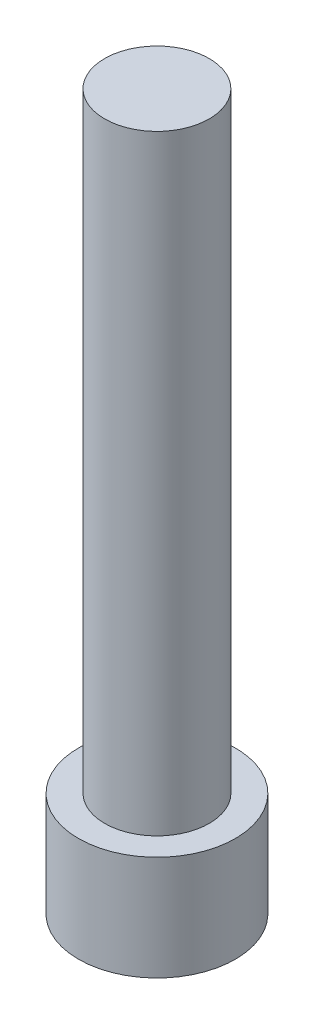
ISO-10303-21;
HEADER;
FILE_DESCRIPTION(('STEP AP214'),'2;1');
FILE_NAME('part.step','',(''),(''),'','','');
FILE_SCHEMA(('AUTOMOTIVE_DESIGN { 1 0 10303 214 1 1 1 1 }'));
ENDSEC;
DATA;
#1=APPLICATION_CONTEXT('core data for automotive mechanical design processes');
#2=APPLICATION_PROTOCOL_DEFINITION('international standard','automotive_design',2000,#1);
#3=PRODUCT_CONTEXT('',#1,'mechanical');
#4=PRODUCT('Part','Part','',(#3));
#5=PRODUCT_RELATED_PRODUCT_CATEGORY('part','',(#4));
#6=PRODUCT_DEFINITION_FORMATION('','',#4);
#7=PRODUCT_DEFINITION_CONTEXT('part definition',#1,'design');
#8=PRODUCT_DEFINITION('design','',#6,#7);
#9=PRODUCT_DEFINITION_SHAPE('','',#8);
#10=(LENGTH_UNIT() NAMED_UNIT(*) SI_UNIT(.MILLI.,.METRE.));
#11=(NAMED_UNIT(*) PLANE_ANGLE_UNIT() SI_UNIT($,.RADIAN.));
#12=(NAMED_UNIT(*) SI_UNIT($,.STERADIAN.) SOLID_ANGLE_UNIT());
#13=UNCERTAINTY_MEASURE_WITH_UNIT(LENGTH_MEASURE(1.E-05),#10,'distance_accuracy_value','');
#14=(GEOMETRIC_REPRESENTATION_CONTEXT(3) GLOBAL_UNCERTAINTY_ASSIGNED_CONTEXT((#13)) GLOBAL_UNIT_ASSIGNED_CONTEXT((#10,
#11,#12)) REPRESENTATION_CONTEXT('',''));
#15=CARTESIAN_POINT('',(0.,0.,0.));
#16=DIRECTION('',(0.,0.,1.));
#17=DIRECTION('',(1.,0.,0.));
#18=AXIS2_PLACEMENT_3D('',#15,#16,#17);
#19=CARTESIAN_POINT('',(0.,12.,0.));
#20=DIRECTION('',(0.,1.,0.));
#21=DIRECTION('',(0.,0.,1.));
#22=AXIS2_PLACEMENT_3D('',#19,#20,#21);
#23=PLANE('',#22);
#24=CARTESIAN_POINT('',(0.,12.,0.));
#25=DIRECTION('',(0.,1.,0.));
#26=DIRECTION('',(0.,0.,1.));
#27=AXIS2_PLACEMENT_3D('',#24,#25,#26);
#28=CIRCLE('',#27,9.);
#29=CARTESIAN_POINT('',(0.,12.,9.));
#30=VERTEX_POINT('',#29);
#31=EDGE_CURVE('E10',#30,#30,#28,.T.);
#32=ORIENTED_EDGE('',*,*,#31,.T.);
#33=EDGE_LOOP('',(#32));
#34=FACE_BOUND('',#33,.T.);
#35=CARTESIAN_POINT('',(0.,12.,0.));
#36=DIRECTION('',(0.,1.,0.));
#37=DIRECTION('',(0.,0.,1.));
#38=AXIS2_PLACEMENT_3D('',#35,#36,#37);
#39=CIRCLE('',#38,6.);
#40=CARTESIAN_POINT('',(0.,12.,6.));
#41=VERTEX_POINT('',#40);
#42=EDGE_CURVE('E42',#41,#41,#39,.T.);
#43=ORIENTED_EDGE('',*,*,#42,.F.);
#44=EDGE_LOOP('',(#43));
#45=FACE_BOUND('',#44,.T.);
#46=ADVANCED_FACE('F29',(#34,#45),#23,.T.);
#47=CARTESIAN_POINT('',(0.,12.,0.));
#48=DIRECTION('',(0.,-1.,0.));
#49=DIRECTION('',(0.,0.,-1.));
#50=AXIS2_PLACEMENT_3D('',#47,#48,#49);
#51=CYLINDRICAL_SURFACE('',#50,9.);
#52=ORIENTED_EDGE('',*,*,#31,.F.);
#53=EDGE_LOOP('',(#52));
#54=FACE_BOUND('',#53,.T.);
#55=CARTESIAN_POINT('',(0.,0.,0.));
#56=DIRECTION('',(0.,1.,0.));
#57=DIRECTION('',(0.,0.,1.));
#58=AXIS2_PLACEMENT_3D('',#55,#56,#57);
#59=CIRCLE('',#58,9.);
#60=CARTESIAN_POINT('',(0.,0.,9.));
#61=VERTEX_POINT('',#60);
#62=EDGE_CURVE('E33',#61,#61,#59,.T.);
#63=ORIENTED_EDGE('',*,*,#62,.T.);
#64=EDGE_LOOP('',(#63));
#65=FACE_BOUND('',#64,.T.);
#66=ADVANCED_FACE('F31',(#54,#65),#51,.T.);
#67=CARTESIAN_POINT('',(0.,0.,0.));
#68=DIRECTION('',(0.,1.,0.));
#69=DIRECTION('',(0.,0.,1.));
#70=AXIS2_PLACEMENT_3D('',#67,#68,#69);
#71=PLANE('',#70);
#72=ORIENTED_EDGE('',*,*,#62,.F.);
#73=EDGE_LOOP('',(#72));
#74=FACE_BOUND('',#73,.T.);
#75=ADVANCED_FACE('F53',(#74),#71,.F.);
#76=CARTESIAN_POINT('',(0.,82.,0.));
#77=DIRECTION('',(0.,-1.,0.));
#78=DIRECTION('',(0.,0.,-1.));
#79=AXIS2_PLACEMENT_3D('',#76,#77,#78);
#80=CYLINDRICAL_SURFACE('',#79,6.);
#81=CARTESIAN_POINT('',(0.,82.,0.));
#82=DIRECTION('',(0.,1.,0.));
#83=DIRECTION('',(0.,0.,1.));
#84=AXIS2_PLACEMENT_3D('',#81,#82,#83);
#85=CIRCLE('',#84,6.);
#86=CARTESIAN_POINT('',(0.,82.,6.));
#87=VERTEX_POINT('',#86);
#88=EDGE_CURVE('E40',#87,#87,#85,.T.);
#89=ORIENTED_EDGE('',*,*,#88,.F.);
#90=EDGE_LOOP('',(#89));
#91=FACE_BOUND('',#90,.T.);
#92=ORIENTED_EDGE('',*,*,#42,.T.);
#93=EDGE_LOOP('',(#92));
#94=FACE_BOUND('',#93,.T.);
#95=ADVANCED_FACE('F50',(#91,#94),#80,.T.);
#96=CARTESIAN_POINT('',(0.,82.,0.));
#97=DIRECTION('',(0.,1.,0.));
#98=DIRECTION('',(0.,0.,1.));
#99=AXIS2_PLACEMENT_3D('',#96,#97,#98);
#100=PLANE('',#99);
#101=ORIENTED_EDGE('',*,*,#88,.T.);
#102=EDGE_LOOP('',(#101));
#103=FACE_BOUND('',#102,.T.);
#104=ADVANCED_FACE('F48',(#103),#100,.T.);
#105=CLOSED_SHELL('',(#46,#66,#75,#95,#104));
#106=MANIFOLD_SOLID_BREP('B2',#105);
#107=ADVANCED_BREP_SHAPE_REPRESENTATION('',(#18,#106),#14);
#108=SHAPE_DEFINITION_REPRESENTATION(#9,#107);
ENDSEC;
END-ISO-10303-21;
